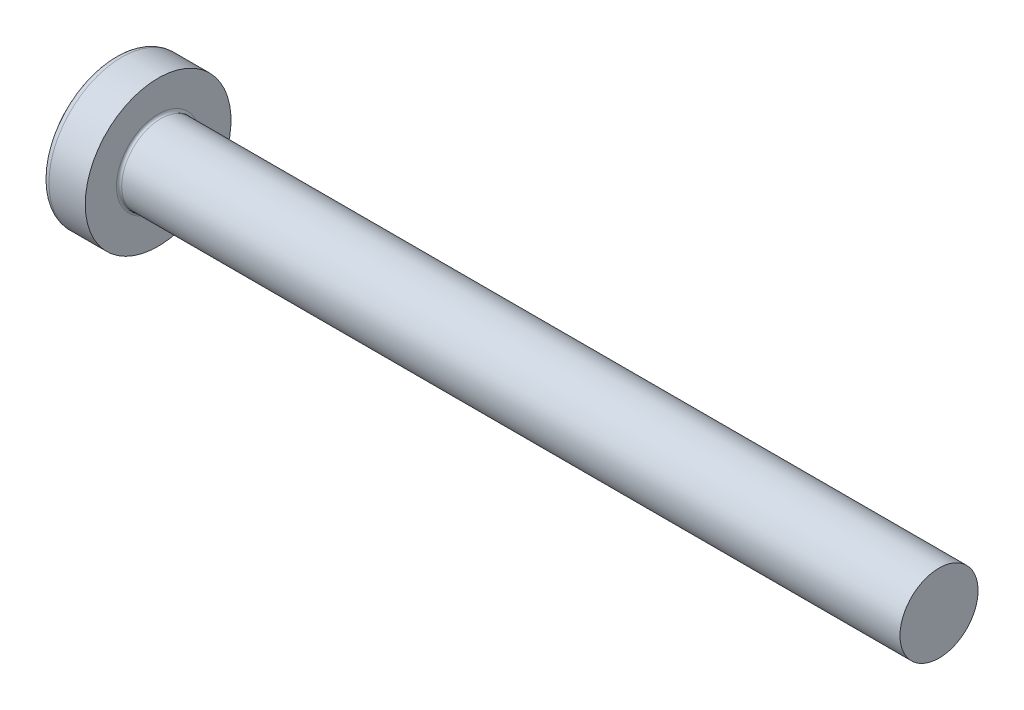
ISO-10303-21;
HEADER;
FILE_DESCRIPTION(('STEP AP214'),'2;1');
FILE_NAME('part.step','',(''),(''),'','','');
FILE_SCHEMA(('AUTOMOTIVE_DESIGN { 1 0 10303 214 1 1 1 1 }'));
ENDSEC;
DATA;
#1=APPLICATION_CONTEXT('core data for automotive mechanical design processes');
#2=APPLICATION_PROTOCOL_DEFINITION('international standard','automotive_design',2000,#1);
#3=PRODUCT_CONTEXT('',#1,'mechanical');
#4=PRODUCT('Part','Part','',(#3));
#5=PRODUCT_RELATED_PRODUCT_CATEGORY('part','',(#4));
#6=PRODUCT_DEFINITION_FORMATION('','',#4);
#7=PRODUCT_DEFINITION_CONTEXT('part definition',#1,'design');
#8=PRODUCT_DEFINITION('design','',#6,#7);
#9=PRODUCT_DEFINITION_SHAPE('','',#8);
#10=(LENGTH_UNIT() NAMED_UNIT(*) SI_UNIT(.MILLI.,.METRE.));
#11=(NAMED_UNIT(*) PLANE_ANGLE_UNIT() SI_UNIT($,.RADIAN.));
#12=(NAMED_UNIT(*) SI_UNIT($,.STERADIAN.) SOLID_ANGLE_UNIT());
#13=UNCERTAINTY_MEASURE_WITH_UNIT(LENGTH_MEASURE(1.E-05),#10,'distance_accuracy_value','');
#14=(GEOMETRIC_REPRESENTATION_CONTEXT(3) GLOBAL_UNCERTAINTY_ASSIGNED_CONTEXT((#13)) GLOBAL_UNIT_ASSIGNED_CONTEXT((#10,
#11,#12)) REPRESENTATION_CONTEXT('',''));
#15=CARTESIAN_POINT('',(0.,0.,0.));
#16=DIRECTION('',(0.,0.,1.));
#17=DIRECTION('',(1.,0.,0.));
#18=AXIS2_PLACEMENT_3D('',#15,#16,#17);
#19=CARTESIAN_POINT('',(5.,0.,0.));
#20=DIRECTION('',(-1.,0.,0.));
#21=DIRECTION('',(0.,1.,0.));
#22=AXIS2_PLACEMENT_3D('',#19,#20,#21);
#23=SPHERICAL_SURFACE('',#22,5.);
#24=CARTESIAN_POINT('',(0.775371598933733,0.,0.));
#25=DIRECTION('',(-1.,0.,0.));
#26=DIRECTION('',(0.,0.,1.));
#27=AXIS2_PLACEMENT_3D('',#24,#25,#26);
#28=CIRCLE('',#27,2.67441860465116);
#29=CARTESIAN_POINT('',(0.775371598933733,0.,2.67441860465116));
#30=VERTEX_POINT('',#29);
#31=EDGE_CURVE('E238',#30,#30,#28,.T.);
#32=ORIENTED_EDGE('',*,*,#31,.T.);
#33=EDGE_LOOP('',(#32));
#34=FACE_BOUND('',#33,.T.);
#35=CARTESIAN_POINT('',(0.0457951200896417,0.,0.));
#36=DIRECTION('',(1.,0.,0.));
#37=DIRECTION('',(0.,0.,-1.));
#38=AXIS2_PLACEMENT_3D('',#35,#36,#37);
#39=CIRCLE('',#38,0.675169614150692);
#40=CARTESIAN_POINT('',(0.0457951200896426,-0.369999999999998,-0.564760133040918));
#41=VERTEX_POINT('',#40);
#42=CARTESIAN_POINT('',(0.0457951200896417,-0.564760133040916,-0.37));
#43=VERTEX_POINT('',#42);
#44=EDGE_CURVE('E374',#41,#43,#39,.F.);
#45=ORIENTED_EDGE('',*,*,#44,.F.);
#46=CARTESIAN_POINT('',(5.,-0.37,0.));
#47=DIRECTION('',(0.,1.,0.));
#48=DIRECTION('',(0.,0.,1.));
#49=AXIS2_PLACEMENT_3D('',#46,#47,#48);
#50=CIRCLE('',#49,4.98629120689917);
#51=CARTESIAN_POINT('',(0.187869731256034,-0.369999999999995,-1.30633161051784));
#52=VERTEX_POINT('',#51);
#53=EDGE_CURVE('E300',#52,#41,#50,.T.);
#54=ORIENTED_EDGE('',*,*,#53,.F.);
#55=CARTESIAN_POINT('',(4.56358245832426,0.,0.875318202045668));
#56=DIRECTION('',(0.446197800778958,0.,-0.89493436774996));
#57=DIRECTION('',(-0.89493436774996,0.,-0.446197800778958));
#58=AXIS2_PLACEMENT_3D('',#55,#56,#57);
#59=CIRCLE('',#58,4.90340267309195);
#60=CARTESIAN_POINT('',(0.187869731256035,0.370000000000005,-1.30633161051784));
#61=VERTEX_POINT('',#60);
#62=EDGE_CURVE('E272',#52,#61,#59,.T.);
#63=ORIENTED_EDGE('',*,*,#62,.T.);
#64=CARTESIAN_POINT('',(5.,0.37,0.));
#65=DIRECTION('',(0.,-1.,0.));
#66=DIRECTION('',(0.,0.,-1.));
#67=AXIS2_PLACEMENT_3D('',#64,#65,#66);
#68=CIRCLE('',#67,4.98629120689917);
#69=CARTESIAN_POINT('',(0.0457951200896421,0.370000000000002,-0.564760133040916));
#70=VERTEX_POINT('',#69);
#71=EDGE_CURVE('E327',#70,#61,#68,.T.);
#72=ORIENTED_EDGE('',*,*,#71,.F.);
#73=CARTESIAN_POINT('',(0.0457951200896417,0.564760133040915,-0.37));
#74=VERTEX_POINT('',#73);
#75=EDGE_CURVE('E393',#74,#70,#39,.F.);
#76=ORIENTED_EDGE('',*,*,#75,.F.);
#77=CARTESIAN_POINT('',(5.,0.,-0.37));
#78=DIRECTION('',(0.,0.,1.));
#79=DIRECTION('',(1.,0.,0.));
#80=AXIS2_PLACEMENT_3D('',#77,#78,#79);
#81=CIRCLE('',#80,4.98629120689917);
#82=CARTESIAN_POINT('',(0.187869731256034,1.30633161051784,-0.37));
#83=VERTEX_POINT('',#82);
#84=EDGE_CURVE('E266',#83,#74,#81,.T.);
#85=ORIENTED_EDGE('',*,*,#84,.F.);
#86=CARTESIAN_POINT('',(4.56358245832426,-0.875318202045668,0.));
#87=DIRECTION('',(0.446197800778958,0.894934367749961,0.));
#88=DIRECTION('',(-0.89493436774996,0.446197800778958,0.));
#89=AXIS2_PLACEMENT_3D('',#86,#87,#88);
#90=CIRCLE('',#89,4.90340267309195);
#91=CARTESIAN_POINT('',(0.187869731256034,1.30633161051784,0.37));
#92=VERTEX_POINT('',#91);
#93=EDGE_CURVE('E269',#83,#92,#90,.T.);
#94=ORIENTED_EDGE('',*,*,#93,.T.);
#95=CARTESIAN_POINT('',(5.,0.,0.37));
#96=DIRECTION('',(0.,0.,-1.));
#97=DIRECTION('',(0.,1.,0.));
#98=AXIS2_PLACEMENT_3D('',#95,#96,#97);
#99=CIRCLE('',#98,4.98629120689917);
#100=CARTESIAN_POINT('',(0.0457951200896417,0.564760133040915,0.37));
#101=VERTEX_POINT('',#100);
#102=EDGE_CURVE('E262',#101,#92,#99,.T.);
#103=ORIENTED_EDGE('',*,*,#102,.F.);
#104=CARTESIAN_POINT('',(0.0457951200896425,0.369999999999998,0.564760133040918));
#105=VERTEX_POINT('',#104);
#106=EDGE_CURVE('E392',#105,#101,#39,.F.);
#107=ORIENTED_EDGE('',*,*,#106,.F.);
#108=CARTESIAN_POINT('',(0.187869731256034,0.369999999999995,1.30633161051784));
#109=VERTEX_POINT('',#108);
#110=EDGE_CURVE('E282',#109,#105,#68,.T.);
#111=ORIENTED_EDGE('',*,*,#110,.F.);
#112=CARTESIAN_POINT('',(4.56358245832426,0.,-0.875318202045668));
#113=DIRECTION('',(0.446197800778958,0.,0.894934367749961));
#114=DIRECTION('',(0.89493436774996,0.,-0.446197800778958));
#115=AXIS2_PLACEMENT_3D('',#112,#113,#114);
#116=CIRCLE('',#115,4.90340267309195);
#117=CARTESIAN_POINT('',(0.187869731256034,-0.370000000000005,1.30633161051784));
#118=VERTEX_POINT('',#117);
#119=EDGE_CURVE('E49',#109,#118,#116,.T.);
#120=ORIENTED_EDGE('',*,*,#119,.T.);
#121=CARTESIAN_POINT('',(0.0457951200896421,-0.370000000000002,0.564760133040916));
#122=VERTEX_POINT('',#121);
#123=EDGE_CURVE('E279',#122,#118,#50,.T.);
#124=ORIENTED_EDGE('',*,*,#123,.F.);
#125=CARTESIAN_POINT('',(0.0457951200896417,-0.564760133040916,0.37));
#126=VERTEX_POINT('',#125);
#127=EDGE_CURVE('E428',#126,#122,#39,.F.);
#128=ORIENTED_EDGE('',*,*,#127,.F.);
#129=CARTESIAN_POINT('',(0.187869731256033,-1.30633161051784,0.37));
#130=VERTEX_POINT('',#129);
#131=EDGE_CURVE('E263',#130,#126,#99,.T.);
#132=ORIENTED_EDGE('',*,*,#131,.F.);
#133=CARTESIAN_POINT('',(4.56358245832426,0.875318202045668,0.));
#134=DIRECTION('',(0.446197800778958,-0.89493436774996,0.));
#135=DIRECTION('',(0.89493436774996,0.446197800778958,0.));
#136=AXIS2_PLACEMENT_3D('',#133,#134,#135);
#137=CIRCLE('',#136,4.90340267309195);
#138=CARTESIAN_POINT('',(0.187869731256033,-1.30633161051784,-0.37));
#139=VERTEX_POINT('',#138);
#140=EDGE_CURVE('E259',#130,#139,#137,.T.);
#141=ORIENTED_EDGE('',*,*,#140,.T.);
#142=EDGE_CURVE('E64',#43,#139,#81,.T.);
#143=ORIENTED_EDGE('',*,*,#142,.F.);
#144=EDGE_LOOP('',(#45,#54,#63,#72,#76,#85,#94,#103,#107,#111,#120,#124,#128,#132,#141,#143));
#145=FACE_BOUND('',#144,.T.);
#146=ADVANCED_FACE('F36',(#34,#145),#23,.T.);
#147=CARTESIAN_POINT('',(1.75,0.527482216012805,-0.37));
#148=DIRECTION('',(0.,0.,1.));
#149=DIRECTION('',(1.,0.,0.));
#150=AXIS2_PLACEMENT_3D('',#147,#148,#149);
#151=PLANE('',#150);
#152=ORIENTED_EDGE('',*,*,#84,.T.);
#153=CARTESIAN_POINT('',(-0.987293237069635,0.649401255968442,-0.37));
#154=CARTESIAN_POINT('',(-0.781914975331301,0.632865887004023,-0.37));
#155=CARTESIAN_POINT('',(-0.576547882405888,0.616188977636102,-0.37));
#156=CARTESIAN_POINT('',(-0.16584159923544,0.582441031964983,-0.37));
#157=CARTESIAN_POINT('',(0.0394975903016338,0.5653699870555,-0.37));
#158=CARTESIAN_POINT('',(0.450133475420601,0.530723441326706,-0.37));
#159=CARTESIAN_POINT('',(0.655430171012341,0.513147940624409,-0.37));
#160=CARTESIAN_POINT('',(1.06596140178858,0.477314957984981,-0.37));
#161=CARTESIAN_POINT('',(1.27119593782008,0.459057485804908,-0.37));
#162=CARTESIAN_POINT('',(1.61065292367297,0.428051938687225,-0.37));
#163=CARTESIAN_POINT('',(1.74490059997313,0.415580824989367,-0.37));
#164=CARTESIAN_POINT('',(2.01334321764434,0.390092023403371,-0.37));
#165=CARTESIAN_POINT('',(2.14753815936247,0.377074339175718,-0.37));
#166=CARTESIAN_POINT('',(2.41586354153627,0.350315629451146,-0.37));
#167=CARTESIAN_POINT('',(2.54999397846979,0.336574568175918,-0.37));
#168=CARTESIAN_POINT('',(2.8181417329714,0.308004077740054,-0.37));
#169=CARTESIAN_POINT('',(2.95215904766802,0.29317462174519,-0.37));
#170=CARTESIAN_POINT('',(3.08609550685347,0.277618485069873,-0.37));
#171=B_SPLINE_CURVE_WITH_KNOTS('',3,(#153,#154,#155,#156,#157,#158,#159,#160,#161,#162,#163,
#164,#165,#166,#167,#168,#169,#170),.UNSPECIFIED.,.F.,.F.,(4,2,2,2,2,2,2,2,4),(0.,
0.61812879398981,1.23627109813549,1.85441325889711,2.47254657920086,2.87702276221884,
3.28149623681436,3.68598973554218,4.09049321035586),.UNSPECIFIED.);
#172=CARTESIAN_POINT('',(1.75,0.415013252800437,-0.370000000000001));
#173=VERTEX_POINT('',#172);
#174=EDGE_CURVE('E414',#74,#173,#171,.T.);
#175=ORIENTED_EDGE('',*,*,#174,.T.);
#176=DIRECTION('',(0.,1.,0.));
#177=VECTOR('',#176,1.);
#178=CARTESIAN_POINT('',(1.75,-0.527482216012805,-0.37));
#179=LINE('',#178,#177);
#180=CARTESIAN_POINT('',(1.75,0.527482216012805,-0.37));
#181=VERTEX_POINT('',#180);
#182=EDGE_CURVE('E356',#173,#181,#179,.T.);
#183=ORIENTED_EDGE('',*,*,#182,.T.);
#184=DIRECTION('',(0.89493436774996,-0.446197800778958,0.));
#185=VECTOR('',#184,1.);
#186=CARTESIAN_POINT('',(0.,1.4,-0.37));
#187=LINE('',#186,#185);
#188=EDGE_CURVE('E239',#83,#181,#187,.T.);
#189=ORIENTED_EDGE('',*,*,#188,.F.);
#190=EDGE_LOOP('',(#152,#175,#183,#189));
#191=FACE_BOUND('',#190,.T.);
#192=ADVANCED_FACE('F194',(#191),#151,.T.);
#193=CARTESIAN_POINT('',(1.75,-0.527482216012805,-0.37));
#194=VERTEX_POINT('',#193);
#195=CARTESIAN_POINT('',(1.75,-0.415013252800437,-0.370000000000001));
#196=VERTEX_POINT('',#195);
#197=EDGE_CURVE('E247',#194,#196,#179,.T.);
#198=ORIENTED_EDGE('',*,*,#197,.T.);
#199=CARTESIAN_POINT('',(-0.987293237069635,-0.649401255968442,-0.37));
#200=CARTESIAN_POINT('',(-0.781914975331301,-0.632865887004023,-0.37));
#201=CARTESIAN_POINT('',(-0.576547882405888,-0.616188977636102,-0.37));
#202=CARTESIAN_POINT('',(-0.16584159923544,-0.582441031964983,-0.37));
#203=CARTESIAN_POINT('',(0.0394975903016338,-0.5653699870555,-0.37));
#204=CARTESIAN_POINT('',(0.450133475420601,-0.530723441326706,-0.37));
#205=CARTESIAN_POINT('',(0.655430171012341,-0.513147940624409,-0.37));
#206=CARTESIAN_POINT('',(1.06596140178858,-0.477314957984981,-0.37));
#207=CARTESIAN_POINT('',(1.27119593782008,-0.459057485804908,-0.37));
#208=CARTESIAN_POINT('',(1.61065292367297,-0.428051938687225,-0.37));
#209=CARTESIAN_POINT('',(1.74490059997313,-0.415580824989367,-0.37));
#210=CARTESIAN_POINT('',(2.01334321764434,-0.390092023403371,-0.37));
#211=CARTESIAN_POINT('',(2.14753815936247,-0.377074339175718,-0.37));
#212=CARTESIAN_POINT('',(2.41586354153627,-0.350315629451146,-0.37));
#213=CARTESIAN_POINT('',(2.54999397846979,-0.336574568175918,-0.37));
#214=CARTESIAN_POINT('',(2.8181417329714,-0.308004077740054,-0.37));
#215=CARTESIAN_POINT('',(2.95215904766802,-0.29317462174519,-0.37));
#216=CARTESIAN_POINT('',(3.08609550685347,-0.277618485069873,-0.37));
#217=B_SPLINE_CURVE_WITH_KNOTS('',3,(#199,#200,#201,#202,#203,#204,#205,#206,#207,#208,#209,
#210,#211,#212,#213,#214,#215,#216),.UNSPECIFIED.,.F.,.F.,(4,2,2,2,2,2,2,2,4),(0.,
0.61812879398981,1.23627109813549,1.85441325889711,2.47254657920086,2.87702276221884,
3.28149623681436,3.68598973554217,4.09049321035586),.UNSPECIFIED.);
#218=EDGE_CURVE('E391',#196,#43,#217,.F.);
#219=ORIENTED_EDGE('',*,*,#218,.T.);
#220=ORIENTED_EDGE('',*,*,#142,.T.);
#221=DIRECTION('',(0.89493436774996,0.446197800778958,0.));
#222=VECTOR('',#221,1.);
#223=CARTESIAN_POINT('',(0.,-1.4,-0.37));
#224=LINE('',#223,#222);
#225=EDGE_CURVE('E330',#139,#194,#224,.T.);
#226=ORIENTED_EDGE('',*,*,#225,.T.);
#227=EDGE_LOOP('',(#198,#219,#220,#226));
#228=FACE_BOUND('',#227,.T.);
#229=ADVANCED_FACE('F200',(#228),#151,.T.);
#230=CARTESIAN_POINT('',(1.75,-0.527482216012805,0.37));
#231=DIRECTION('',(0.,0.,-1.));
#232=DIRECTION('',(0.,1.,0.));
#233=AXIS2_PLACEMENT_3D('',#230,#231,#232);
#234=PLANE('',#233);
#235=DIRECTION('',(0.,-1.,0.));
#236=VECTOR('',#235,1.);
#237=CARTESIAN_POINT('',(1.75,0.527482216012805,0.37));
#238=LINE('',#237,#236);
#239=CARTESIAN_POINT('',(1.75,0.527482216012805,0.37));
#240=VERTEX_POINT('',#239);
#241=CARTESIAN_POINT('',(1.75,0.415013252800437,0.370000000000001));
#242=VERTEX_POINT('',#241);
#243=EDGE_CURVE('E339',#240,#242,#238,.T.);
#244=ORIENTED_EDGE('',*,*,#243,.T.);
#245=CARTESIAN_POINT('',(-0.987293237053716,0.649401255967161,0.37));
#246=CARTESIAN_POINT('',(-0.781914975317084,0.632865887002871,0.37));
#247=CARTESIAN_POINT('',(-0.576547882393372,0.616188977635081,0.37));
#248=CARTESIAN_POINT('',(-0.165841599226327,0.582441031964227,0.37));
#249=CARTESIAN_POINT('',(0.0394975903090453,0.56536998705488,0.37));
#250=CARTESIAN_POINT('',(0.450133475422572,0.530723441326535,0.37));
#251=CARTESIAN_POINT('',(0.655430171010574,0.513147940624557,0.37));
#252=CARTESIAN_POINT('',(1.06596140177934,0.477314957985794,0.37));
#253=CARTESIAN_POINT('',(1.2711959378071,0.459057485806066,0.37));
#254=CARTESIAN_POINT('',(1.61065292365626,0.428051938688768,0.37));
#255=CARTESIAN_POINT('',(1.74490059995643,0.415580824990931,0.37));
#256=CARTESIAN_POINT('',(2.01334321762763,0.390092023404979,0.37));
#257=CARTESIAN_POINT('',(2.14753815934577,0.377074339177353,0.37));
#258=CARTESIAN_POINT('',(2.41586354151957,0.350315629452842,0.37));
#259=CARTESIAN_POINT('',(2.5499939784531,0.33657456817765,0.37));
#260=CARTESIAN_POINT('',(2.81814173295471,0.308004077741875,0.37));
#261=CARTESIAN_POINT('',(2.95215904765134,0.293174621747065,0.37));
#262=CARTESIAN_POINT('',(3.0860955068368,0.277618485071816,0.37));
#263=B_SPLINE_CURVE_WITH_KNOTS('',3,(#245,#246,#247,#248,#249,#250,#251,#252,#253,#254,#255,
#256,#257,#258,#259,#260,#261,#262),.UNSPECIFIED.,.F.,.F.,(4,2,2,2,2,2,2,2,4),(0.,
0.618128793984691,1.23627109812525,1.85441325887562,2.4725465791681,2.87702276218609,
3.28149623678161,3.68598973550942,4.09049321032311),.UNSPECIFIED.);
#264=EDGE_CURVE('E666',#242,#101,#263,.F.);
#265=ORIENTED_EDGE('',*,*,#264,.T.);
#266=ORIENTED_EDGE('',*,*,#102,.T.);
#267=DIRECTION('',(0.89493436774996,-0.446197800778958,0.));
#268=VECTOR('',#267,1.);
#269=CARTESIAN_POINT('',(0.,1.4,0.37));
#270=LINE('',#269,#268);
#271=EDGE_CURVE('E244',#92,#240,#270,.T.);
#272=ORIENTED_EDGE('',*,*,#271,.T.);
#273=EDGE_LOOP('',(#244,#265,#266,#272));
#274=FACE_BOUND('',#273,.T.);
#275=ADVANCED_FACE('F410',(#274),#234,.T.);
#276=ORIENTED_EDGE('',*,*,#131,.T.);
#277=CARTESIAN_POINT('',(-0.987293237069635,-0.649401255968442,0.37));
#278=CARTESIAN_POINT('',(-0.781914975331301,-0.632865887004023,0.37));
#279=CARTESIAN_POINT('',(-0.576547882405888,-0.616188977636102,0.37));
#280=CARTESIAN_POINT('',(-0.16584159923544,-0.582441031964983,0.37));
#281=CARTESIAN_POINT('',(0.0394975903016338,-0.5653699870555,0.37));
#282=CARTESIAN_POINT('',(0.450133475420601,-0.530723441326706,0.37));
#283=CARTESIAN_POINT('',(0.655430171012341,-0.513147940624409,0.37));
#284=CARTESIAN_POINT('',(1.06596140178858,-0.477314957984981,0.37));
#285=CARTESIAN_POINT('',(1.27119593782008,-0.459057485804908,0.37));
#286=CARTESIAN_POINT('',(1.61065292367297,-0.428051938687225,0.37));
#287=CARTESIAN_POINT('',(1.74490059997313,-0.415580824989368,0.37));
#288=CARTESIAN_POINT('',(2.01334321764434,-0.390092023403371,0.37));
#289=CARTESIAN_POINT('',(2.14753815936247,-0.377074339175718,0.37));
#290=CARTESIAN_POINT('',(2.41586354153627,-0.350315629451146,0.37));
#291=CARTESIAN_POINT('',(2.54999397846979,-0.336574568175918,0.37));
#292=CARTESIAN_POINT('',(2.8181417329714,-0.308004077740054,0.37));
#293=CARTESIAN_POINT('',(2.95215904766802,-0.29317462174519,0.37));
#294=CARTESIAN_POINT('',(3.08609550685347,-0.277618485069873,0.37));
#295=B_SPLINE_CURVE_WITH_KNOTS('',3,(#277,#278,#279,#280,#281,#282,#283,#284,#285,#286,#287,
#288,#289,#290,#291,#292,#293,#294),.UNSPECIFIED.,.F.,.F.,(4,2,2,2,2,2,2,2,4),(0.,
0.61812879398981,1.23627109813549,1.85441325889711,2.47254657920086,2.87702276221884,
3.28149623681437,3.68598973554218,4.09049321035586),.UNSPECIFIED.);
#296=CARTESIAN_POINT('',(1.75,-0.415013252800437,0.37));
#297=VERTEX_POINT('',#296);
#298=EDGE_CURVE('E429',#126,#297,#295,.T.);
#299=ORIENTED_EDGE('',*,*,#298,.T.);
#300=CARTESIAN_POINT('',(1.75,-0.527482216012806,0.37));
#301=VERTEX_POINT('',#300);
#302=EDGE_CURVE('E341',#297,#301,#238,.T.);
#303=ORIENTED_EDGE('',*,*,#302,.T.);
#304=DIRECTION('',(0.89493436774996,0.446197800778958,0.));
#305=VECTOR('',#304,1.);
#306=CARTESIAN_POINT('',(0.,-1.4,0.37));
#307=LINE('',#306,#305);
#308=EDGE_CURVE('E332',#130,#301,#307,.T.);
#309=ORIENTED_EDGE('',*,*,#308,.F.);
#310=EDGE_LOOP('',(#276,#299,#303,#309));
#311=FACE_BOUND('',#310,.T.);
#312=ADVANCED_FACE('F520',(#311),#234,.T.);
#313=CARTESIAN_POINT('',(1.75,0.527482216012805,0.37));
#314=DIRECTION('',(0.446197800778958,0.894934367749961,0.));
#315=DIRECTION('',(-0.89493436774996,0.446197800778958,0.));
#316=AXIS2_PLACEMENT_3D('',#313,#314,#315);
#317=PLANE('',#316);
#318=CARTESIAN_POINT('',(2.66965234556629,0.0689604865315898,0.));
#319=DIRECTION('',(0.446197800778958,0.894934367749961,0.));
#320=DIRECTION('',(-0.89493436774996,0.446197800778958,0.));
#321=AXIS2_PLACEMENT_3D('',#318,#319,#320);
#322=ELLIPSE('',#321,1.10195891266117,0.486831719863514);
#323=CARTESIAN_POINT('',(1.75,0.527482216012806,0.175779725196677));
#324=VERTEX_POINT('',#323);
#325=CARTESIAN_POINT('',(1.75,0.527482216012806,-0.175779725196677));
#326=VERTEX_POINT('',#325);
#327=EDGE_CURVE('E305',#324,#326,#322,.F.);
#328=ORIENTED_EDGE('',*,*,#327,.F.);
#329=DIRECTION('',(0.,0.,-1.));
#330=VECTOR('',#329,1.);
#331=CARTESIAN_POINT('',(1.75,0.527482216012805,0.37));
#332=LINE('',#331,#330);
#333=EDGE_CURVE('E342',#240,#324,#332,.T.);
#334=ORIENTED_EDGE('',*,*,#333,.F.);
#335=ORIENTED_EDGE('',*,*,#271,.F.);
#336=ORIENTED_EDGE('',*,*,#93,.F.);
#337=ORIENTED_EDGE('',*,*,#188,.T.);
#338=EDGE_CURVE('E344',#326,#181,#332,.T.);
#339=ORIENTED_EDGE('',*,*,#338,.F.);
#340=EDGE_LOOP('',(#328,#334,#335,#336,#337,#339));
#341=FACE_BOUND('',#340,.T.);
#342=ADVANCED_FACE('F408',(#341),#317,.F.);
#343=CARTESIAN_POINT('',(1.75,-0.527482216012805,-0.37));
#344=DIRECTION('',(0.446197800778958,-0.89493436774996,0.));
#345=DIRECTION('',(0.89493436774996,0.446197800778958,0.));
#346=AXIS2_PLACEMENT_3D('',#343,#344,#345);
#347=PLANE('',#346);
#348=CARTESIAN_POINT('',(2.66965234556629,-0.0689604865315901,0.));
#349=DIRECTION('',(0.446197800778958,-0.89493436774996,0.));
#350=DIRECTION('',(-0.89493436774996,-0.446197800778958,0.));
#351=AXIS2_PLACEMENT_3D('',#348,#349,#350);
#352=ELLIPSE('',#351,1.10195891266117,0.486831719863513);
#353=CARTESIAN_POINT('',(1.75,-0.527482216012806,-0.175779725196677));
#354=VERTEX_POINT('',#353);
#355=CARTESIAN_POINT('',(1.75,-0.527482216012806,0.175779725196677));
#356=VERTEX_POINT('',#355);
#357=EDGE_CURVE('E668',#354,#356,#352,.F.);
#358=ORIENTED_EDGE('',*,*,#357,.F.);
#359=DIRECTION('',(0.,0.,1.));
#360=VECTOR('',#359,1.);
#361=CARTESIAN_POINT('',(1.75,-0.527482216012805,-0.37));
#362=LINE('',#361,#360);
#363=EDGE_CURVE('E335',#194,#354,#362,.T.);
#364=ORIENTED_EDGE('',*,*,#363,.F.);
#365=ORIENTED_EDGE('',*,*,#225,.F.);
#366=ORIENTED_EDGE('',*,*,#140,.F.);
#367=ORIENTED_EDGE('',*,*,#308,.T.);
#368=EDGE_CURVE('E338',#356,#301,#362,.T.);
#369=ORIENTED_EDGE('',*,*,#368,.F.);
#370=EDGE_LOOP('',(#358,#364,#365,#366,#367,#369));
#371=FACE_BOUND('',#370,.T.);
#372=ADVANCED_FACE('F507',(#371),#347,.F.);
#373=CARTESIAN_POINT('',(1.75,0.527482216012805,-0.37));
#374=DIRECTION('',(-1.,0.,0.));
#375=DIRECTION('',(0.,0.,1.));
#376=AXIS2_PLACEMENT_3D('',#373,#374,#375);
#377=PLANE('',#376);
#378=DIRECTION('',(0.,1.,0.));
#379=VECTOR('',#378,1.);
#380=CARTESIAN_POINT('',(1.75,-0.370000000000002,0.527482216012804));
#381=LINE('',#380,#379);
#382=CARTESIAN_POINT('',(1.75,-0.370000000000002,0.527482216012804));
#383=VERTEX_POINT('',#382);
#384=CARTESIAN_POINT('',(1.75,-0.175779725196681,0.527482216012805));
#385=VERTEX_POINT('',#384);
#386=EDGE_CURVE('E320',#383,#385,#381,.T.);
#387=ORIENTED_EDGE('',*,*,#386,.T.);
#388=CARTESIAN_POINT('',(1.75,0.,0.));
#389=DIRECTION('',(-1.,0.,0.));
#390=DIRECTION('',(0.,0.,1.));
#391=AXIS2_PLACEMENT_3D('',#388,#389,#390);
#392=CIRCLE('',#391,0.556);
#393=CARTESIAN_POINT('',(1.75,-0.370000000000001,0.415013252800436));
#394=VERTEX_POINT('',#393);
#395=EDGE_CURVE('E694',#394,#385,#392,.T.);
#396=ORIENTED_EDGE('',*,*,#395,.F.);
#397=DIRECTION('',(0.,0.,-1.));
#398=VECTOR('',#397,1.);
#399=CARTESIAN_POINT('',(1.75,-0.370000000000002,0.527482216012804));
#400=LINE('',#399,#398);
#401=EDGE_CURVE('E316',#383,#394,#400,.T.);
#402=ORIENTED_EDGE('',*,*,#401,.F.);
#403=EDGE_LOOP('',(#387,#396,#402));
#404=FACE_BOUND('',#403,.T.);
#405=ADVANCED_FACE('F464',(#404),#377,.T.);
#406=ORIENTED_EDGE('',*,*,#302,.F.);
#407=EDGE_CURVE('E699',#356,#297,#392,.T.);
#408=ORIENTED_EDGE('',*,*,#407,.F.);
#409=ORIENTED_EDGE('',*,*,#368,.T.);
#410=EDGE_LOOP('',(#406,#408,#409));
#411=FACE_BOUND('',#410,.T.);
#412=ADVANCED_FACE('F494',(#411),#377,.T.);
#413=ORIENTED_EDGE('',*,*,#363,.T.);
#414=EDGE_CURVE('E385',#196,#354,#392,.T.);
#415=ORIENTED_EDGE('',*,*,#414,.F.);
#416=ORIENTED_EDGE('',*,*,#197,.F.);
#417=EDGE_LOOP('',(#413,#415,#416));
#418=FACE_BOUND('',#417,.T.);
#419=ADVANCED_FACE('F488',(#418),#377,.T.);
#420=CARTESIAN_POINT('',(1.75,-0.369999999999998,-0.415013252800438));
#421=VERTEX_POINT('',#420);
#422=CARTESIAN_POINT('',(1.75,-0.369999999999998,-0.527482216012807));
#423=VERTEX_POINT('',#422);
#424=EDGE_CURVE('E319',#421,#423,#400,.T.);
#425=ORIENTED_EDGE('',*,*,#424,.F.);
#426=CARTESIAN_POINT('',(1.75,-0.175779725196677,-0.527482216012806));
#427=VERTEX_POINT('',#426);
#428=EDGE_CURVE('E56',#427,#421,#392,.T.);
#429=ORIENTED_EDGE('',*,*,#428,.F.);
#430=DIRECTION('',(0.,-1.,0.));
#431=VECTOR('',#430,1.);
#432=CARTESIAN_POINT('',(1.75,0.370000000000002,-0.527482216012804));
#433=LINE('',#432,#431);
#434=EDGE_CURVE('E315',#427,#423,#433,.T.);
#435=ORIENTED_EDGE('',*,*,#434,.T.);
#436=EDGE_LOOP('',(#425,#429,#435));
#437=FACE_BOUND('',#436,.T.);
#438=ADVANCED_FACE('F380',(#437),#377,.T.);
#439=CARTESIAN_POINT('',(1.75,0.370000000000002,-0.527482216012804));
#440=VERTEX_POINT('',#439);
#441=CARTESIAN_POINT('',(1.75,0.175779725196681,-0.527482216012805));
#442=VERTEX_POINT('',#441);
#443=EDGE_CURVE('E312',#440,#442,#433,.T.);
#444=ORIENTED_EDGE('',*,*,#443,.T.);
#445=CARTESIAN_POINT('',(1.75,0.370000000000001,-0.415013252800436));
#446=VERTEX_POINT('',#445);
#447=EDGE_CURVE('E384',#446,#442,#392,.T.);
#448=ORIENTED_EDGE('',*,*,#447,.F.);
#449=DIRECTION('',(0.,0.,1.));
#450=VECTOR('',#449,1.);
#451=CARTESIAN_POINT('',(1.75,0.370000000000002,-0.527482216012804));
#452=LINE('',#451,#450);
#453=EDGE_CURVE('E324',#440,#446,#452,.T.);
#454=ORIENTED_EDGE('',*,*,#453,.F.);
#455=EDGE_LOOP('',(#444,#448,#454));
#456=FACE_BOUND('',#455,.T.);
#457=ADVANCED_FACE('F476',(#456),#377,.T.);
#458=ORIENTED_EDGE('',*,*,#182,.F.);
#459=EDGE_CURVE('E683',#326,#173,#392,.T.);
#460=ORIENTED_EDGE('',*,*,#459,.F.);
#461=ORIENTED_EDGE('',*,*,#338,.T.);
#462=EDGE_LOOP('',(#458,#460,#461));
#463=FACE_BOUND('',#462,.T.);
#464=ADVANCED_FACE('F470',(#463),#377,.T.);
#465=ORIENTED_EDGE('',*,*,#333,.T.);
#466=EDGE_CURVE('E685',#242,#324,#392,.T.);
#467=ORIENTED_EDGE('',*,*,#466,.F.);
#468=ORIENTED_EDGE('',*,*,#243,.F.);
#469=EDGE_LOOP('',(#465,#467,#468));
#470=FACE_BOUND('',#469,.T.);
#471=ADVANCED_FACE('F462',(#470),#377,.T.);
#472=CARTESIAN_POINT('',(1.75,0.369999999999998,0.415013252800439));
#473=VERTEX_POINT('',#472);
#474=CARTESIAN_POINT('',(1.75,0.369999999999998,0.527482216012807));
#475=VERTEX_POINT('',#474);
#476=EDGE_CURVE('E297',#473,#475,#452,.T.);
#477=ORIENTED_EDGE('',*,*,#476,.F.);
#478=CARTESIAN_POINT('',(1.75,0.175779725196677,0.527482216012806));
#479=VERTEX_POINT('',#478);
#480=EDGE_CURVE('E386',#479,#473,#392,.T.);
#481=ORIENTED_EDGE('',*,*,#480,.F.);
#482=EDGE_CURVE('E323',#479,#475,#381,.T.);
#483=ORIENTED_EDGE('',*,*,#482,.T.);
#484=EDGE_LOOP('',(#477,#481,#483));
#485=FACE_BOUND('',#484,.T.);
#486=ADVANCED_FACE('F456',(#485),#377,.T.);
#487=CARTESIAN_POINT('',(1.75,0.369999999999998,0.527482216012807));
#488=DIRECTION('',(0.,-1.,0.));
#489=DIRECTION('',(1.,0.,0.));
#490=AXIS2_PLACEMENT_3D('',#487,#488,#489);
#491=PLANE('',#490);
#492=ORIENTED_EDGE('',*,*,#110,.T.);
#493=CARTESIAN_POINT('',(-0.987293237053716,0.369999999999998,0.649401255967162));
#494=CARTESIAN_POINT('',(-0.781914975317084,0.369999999999998,0.632865887002872));
#495=CARTESIAN_POINT('',(-0.576547882393372,0.369999999999998,0.616188977635082));
#496=CARTESIAN_POINT('',(-0.165841599226327,0.369999999999998,0.582441031964228));
#497=CARTESIAN_POINT('',(0.0394975903090453,0.369999999999998,0.565369987054881));
#498=CARTESIAN_POINT('',(0.450133475422572,0.369999999999998,0.530723441326536));
#499=CARTESIAN_POINT('',(0.655430171010573,0.369999999999998,0.513147940624558));
#500=CARTESIAN_POINT('',(1.06596140177934,0.369999999999998,0.477314957985795));
#501=CARTESIAN_POINT('',(1.2711959378071,0.369999999999998,0.459057485806067));
#502=CARTESIAN_POINT('',(1.61065292365626,0.369999999999998,0.42805193868877));
#503=CARTESIAN_POINT('',(1.74490059995643,0.369999999999998,0.415580824990932));
#504=CARTESIAN_POINT('',(2.01334321762763,0.369999999999999,0.390092023404981));
#505=CARTESIAN_POINT('',(2.14753815934577,0.369999999999999,0.377074339177355));
#506=CARTESIAN_POINT('',(2.41586354151957,0.369999999999999,0.350315629452844));
#507=CARTESIAN_POINT('',(2.5499939784531,0.369999999999999,0.336574568177652));
#508=CARTESIAN_POINT('',(2.81814173295471,0.369999999999999,0.308004077741877));
#509=CARTESIAN_POINT('',(2.95215904765134,0.369999999999999,0.293174621747066));
#510=CARTESIAN_POINT('',(3.0860955068368,0.369999999999999,0.277618485071817));
#511=B_SPLINE_CURVE_WITH_KNOTS('',3,(#493,#494,#495,#496,#497,#498,#499,#500,#501,#502,#503,
#504,#505,#506,#507,#508,#509,#510),.UNSPECIFIED.,.F.,.F.,(4,2,2,2,2,2,2,2,4),(0.,
0.618128793984691,1.23627109812525,1.85441325887562,2.4725465791681,2.87702276218609,
3.28149623678161,3.68598973550942,4.09049321032311),.UNSPECIFIED.);
#512=EDGE_CURVE('E665',#105,#473,#511,.T.);
#513=ORIENTED_EDGE('',*,*,#512,.T.);
#514=ORIENTED_EDGE('',*,*,#476,.T.);
#515=DIRECTION('',(0.89493436774996,0.,-0.446197800778958));
#516=VECTOR('',#515,1.);
#517=CARTESIAN_POINT('',(0.,0.369999999999995,1.4));
#518=LINE('',#517,#516);
#519=EDGE_CURVE('E290',#109,#475,#518,.T.);
#520=ORIENTED_EDGE('',*,*,#519,.F.);
#521=EDGE_LOOP('',(#492,#513,#514,#520));
#522=FACE_BOUND('',#521,.T.);
#523=ADVANCED_FACE('F294',(#522),#491,.T.);
#524=CARTESIAN_POINT('',(1.75,-0.369999999999998,-0.527482216012807));
#525=DIRECTION('',(0.,1.,0.));
#526=DIRECTION('',(0.,0.,1.));
#527=AXIS2_PLACEMENT_3D('',#524,#525,#526);
#528=PLANE('',#527);
#529=ORIENTED_EDGE('',*,*,#401,.T.);
#530=CARTESIAN_POINT('',(-0.987293237053716,-0.370000000000002,0.64940125596716));
#531=CARTESIAN_POINT('',(-0.781914975317084,-0.370000000000002,0.63286588700287));
#532=CARTESIAN_POINT('',(-0.576547882393372,-0.370000000000002,0.61618897763508));
#533=CARTESIAN_POINT('',(-0.165841599226327,-0.370000000000002,0.582441031964225));
#534=CARTESIAN_POINT('',(0.0394975903090451,-0.370000000000002,0.565369987054878));
#535=CARTESIAN_POINT('',(0.450133475422572,-0.370000000000002,0.530723441326533));
#536=CARTESIAN_POINT('',(0.655430171010573,-0.370000000000002,0.513147940624555));
#537=CARTESIAN_POINT('',(1.06596140177934,-0.370000000000002,0.477314957985793));
#538=CARTESIAN_POINT('',(1.2711959378071,-0.370000000000002,0.459057485806065));
#539=CARTESIAN_POINT('',(1.61065292365626,-0.370000000000001,0.428051938688767));
#540=CARTESIAN_POINT('',(1.74490059995642,-0.370000000000001,0.41558082499093));
#541=CARTESIAN_POINT('',(2.01334321762763,-0.370000000000001,0.390092023404978));
#542=CARTESIAN_POINT('',(2.14753815934577,-0.370000000000001,0.377074339177352));
#543=CARTESIAN_POINT('',(2.41586354151957,-0.370000000000001,0.350315629452841));
#544=CARTESIAN_POINT('',(2.5499939784531,-0.370000000000001,0.336574568177649));
#545=CARTESIAN_POINT('',(2.81814173295471,-0.370000000000001,0.308004077741874));
#546=CARTESIAN_POINT('',(2.95215904765134,-0.370000000000001,0.293174621747063));
#547=CARTESIAN_POINT('',(3.0860955068368,-0.370000000000001,0.277618485071814));
#548=B_SPLINE_CURVE_WITH_KNOTS('',3,(#530,#531,#532,#533,#534,#535,#536,#537,#538,#539,#540,
#541,#542,#543,#544,#545,#546,#547),.UNSPECIFIED.,.F.,.F.,(4,2,2,2,2,2,2,2,4),(0.,
0.618128793984691,1.23627109812525,1.85441325887562,2.4725465791681,2.87702276218609,
3.28149623678161,3.68598973550942,4.09049321032311),.UNSPECIFIED.);
#549=EDGE_CURVE('E422',#394,#122,#548,.F.);
#550=ORIENTED_EDGE('',*,*,#549,.T.);
#551=ORIENTED_EDGE('',*,*,#123,.T.);
#552=DIRECTION('',(0.89493436774996,0.,-0.446197800778958));
#553=VECTOR('',#552,1.);
#554=CARTESIAN_POINT('',(0.,-0.370000000000005,1.4));
#555=LINE('',#554,#553);
#556=EDGE_CURVE('E292',#118,#383,#555,.T.);
#557=ORIENTED_EDGE('',*,*,#556,.T.);
#558=EDGE_LOOP('',(#529,#550,#551,#557));
#559=FACE_BOUND('',#558,.T.);
#560=ADVANCED_FACE('F229',(#559),#528,.T.);
#561=CARTESIAN_POINT('',(1.75,-0.370000000000002,0.527482216012804));
#562=DIRECTION('',(0.446197800778958,0.,0.894934367749961));
#563=DIRECTION('',(-0.89493436774996,0.,0.446197800778958));
#564=AXIS2_PLACEMENT_3D('',#561,#562,#563);
#565=PLANE('',#564);
#566=CARTESIAN_POINT('',(2.66965234556629,0.,0.0689604865315898));
#567=DIRECTION('',(0.446197800778958,0.,0.894934367749961));
#568=DIRECTION('',(-0.89493436774996,0.,0.446197800778958));
#569=AXIS2_PLACEMENT_3D('',#566,#567,#568);
#570=ELLIPSE('',#569,1.10195891266117,0.486831719863514);
#571=EDGE_CURVE('E420',#385,#479,#570,.F.);
#572=ORIENTED_EDGE('',*,*,#571,.F.);
#573=ORIENTED_EDGE('',*,*,#386,.F.);
#574=ORIENTED_EDGE('',*,*,#556,.F.);
#575=ORIENTED_EDGE('',*,*,#119,.F.);
#576=ORIENTED_EDGE('',*,*,#519,.T.);
#577=ORIENTED_EDGE('',*,*,#482,.F.);
#578=EDGE_LOOP('',(#572,#573,#574,#575,#576,#577));
#579=FACE_BOUND('',#578,.T.);
#580=ADVANCED_FACE('F288',(#579),#565,.F.);
#581=CARTESIAN_POINT('',(1.75,0.370000000000002,-0.527482216012804));
#582=DIRECTION('',(0.446197800778958,0.,-0.89493436774996));
#583=DIRECTION('',(0.89493436774996,0.,0.446197800778958));
#584=AXIS2_PLACEMENT_3D('',#581,#582,#583);
#585=PLANE('',#584);
#586=CARTESIAN_POINT('',(2.66965234556629,0.,-0.0689604865315901));
#587=DIRECTION('',(0.446197800778958,0.,-0.89493436774996));
#588=DIRECTION('',(-0.89493436774996,0.,-0.446197800778958));
#589=AXIS2_PLACEMENT_3D('',#586,#587,#588);
#590=ELLIPSE('',#589,1.10195891266117,0.486831719863513);
#591=EDGE_CURVE('E378',#442,#427,#590,.F.);
#592=ORIENTED_EDGE('',*,*,#591,.F.);
#593=ORIENTED_EDGE('',*,*,#443,.F.);
#594=DIRECTION('',(0.89493436774996,0.,0.446197800778958));
#595=VECTOR('',#594,1.);
#596=CARTESIAN_POINT('',(0.,0.370000000000005,-1.4));
#597=LINE('',#596,#595);
#598=EDGE_CURVE('E302',#61,#440,#597,.T.);
#599=ORIENTED_EDGE('',*,*,#598,.F.);
#600=ORIENTED_EDGE('',*,*,#62,.F.);
#601=DIRECTION('',(0.89493436774996,0.,0.446197800778958));
#602=VECTOR('',#601,1.);
#603=CARTESIAN_POINT('',(0.,-0.369999999999995,-1.4));
#604=LINE('',#603,#602);
#605=EDGE_CURVE('E309',#52,#423,#604,.T.);
#606=ORIENTED_EDGE('',*,*,#605,.T.);
#607=ORIENTED_EDGE('',*,*,#434,.F.);
#608=EDGE_LOOP('',(#592,#593,#599,#600,#606,#607));
#609=FACE_BOUND('',#608,.T.);
#610=ADVANCED_FACE('F369',(#609),#585,.F.);
#611=ORIENTED_EDGE('',*,*,#453,.T.);
#612=CARTESIAN_POINT('',(-0.987293237069635,0.370000000000002,-0.649401255968441));
#613=CARTESIAN_POINT('',(-0.781914975331301,0.370000000000002,-0.632865887004022));
#614=CARTESIAN_POINT('',(-0.576547882405888,0.370000000000002,-0.616188977636101));
#615=CARTESIAN_POINT('',(-0.16584159923544,0.370000000000002,-0.582441031964981));
#616=CARTESIAN_POINT('',(0.0394975903016338,0.370000000000002,-0.565369987055499));
#617=CARTESIAN_POINT('',(0.450133475420601,0.370000000000002,-0.530723441326705));
#618=CARTESIAN_POINT('',(0.655430171012341,0.370000000000002,-0.513147940624407));
#619=CARTESIAN_POINT('',(1.06596140178858,0.370000000000002,-0.47731495798498));
#620=CARTESIAN_POINT('',(1.27119593782008,0.370000000000002,-0.459057485804906));
#621=CARTESIAN_POINT('',(1.61065292367297,0.370000000000001,-0.428051938687223));
#622=CARTESIAN_POINT('',(1.74490059997313,0.370000000000001,-0.415580824989366));
#623=CARTESIAN_POINT('',(2.01334321764434,0.370000000000001,-0.390092023403369));
#624=CARTESIAN_POINT('',(2.14753815936247,0.370000000000001,-0.377074339175717));
#625=CARTESIAN_POINT('',(2.41586354153627,0.370000000000001,-0.350315629451145));
#626=CARTESIAN_POINT('',(2.54999397846979,0.370000000000001,-0.336574568175917));
#627=CARTESIAN_POINT('',(2.8181417329714,0.370000000000001,-0.308004077740052));
#628=CARTESIAN_POINT('',(2.95215904766802,0.370000000000001,-0.293174621745188));
#629=CARTESIAN_POINT('',(3.08609550685347,0.370000000000001,-0.277618485069872));
#630=B_SPLINE_CURVE_WITH_KNOTS('',3,(#612,#613,#614,#615,#616,#617,#618,#619,#620,#621,#622,
#623,#624,#625,#626,#627,#628,#629),.UNSPECIFIED.,.F.,.F.,(4,2,2,2,2,2,2,2,4),(0.,
0.61812879398981,1.23627109813549,1.85441325889711,2.47254657920086,2.87702276221884,
3.28149623681436,3.68598973554217,4.09049321035586),.UNSPECIFIED.);
#631=EDGE_CURVE('E365',#446,#70,#630,.F.);
#632=ORIENTED_EDGE('',*,*,#631,.T.);
#633=ORIENTED_EDGE('',*,*,#71,.T.);
#634=ORIENTED_EDGE('',*,*,#598,.T.);
#635=EDGE_LOOP('',(#611,#632,#633,#634));
#636=FACE_BOUND('',#635,.T.);
#637=ADVANCED_FACE('F227',(#636),#491,.T.);
#638=ORIENTED_EDGE('',*,*,#53,.T.);
#639=CARTESIAN_POINT('',(-0.987293237069635,-0.369999999999997,-0.649401255968443));
#640=CARTESIAN_POINT('',(-0.781914975331301,-0.369999999999997,-0.632865887004025));
#641=CARTESIAN_POINT('',(-0.576547882405888,-0.369999999999997,-0.616188977636104));
#642=CARTESIAN_POINT('',(-0.16584159923544,-0.369999999999998,-0.582441031964984));
#643=CARTESIAN_POINT('',(0.0394975903016337,-0.369999999999998,-0.565369987055501));
#644=CARTESIAN_POINT('',(0.450133475420601,-0.369999999999998,-0.530723441326707));
#645=CARTESIAN_POINT('',(0.655430171012341,-0.369999999999998,-0.51314794062441));
#646=CARTESIAN_POINT('',(1.06596140178858,-0.369999999999998,-0.477314957984982));
#647=CARTESIAN_POINT('',(1.27119593782008,-0.369999999999998,-0.459057485804909));
#648=CARTESIAN_POINT('',(1.61065292367297,-0.369999999999998,-0.428051938687226));
#649=CARTESIAN_POINT('',(1.74490059997313,-0.369999999999998,-0.415580824989369));
#650=CARTESIAN_POINT('',(2.01334321764434,-0.369999999999999,-0.390092023403372));
#651=CARTESIAN_POINT('',(2.14753815936247,-0.369999999999999,-0.37707433917572));
#652=CARTESIAN_POINT('',(2.41586354153627,-0.369999999999999,-0.350315629451147));
#653=CARTESIAN_POINT('',(2.54999397846979,-0.369999999999999,-0.336574568175919));
#654=CARTESIAN_POINT('',(2.8181417329714,-0.369999999999999,-0.308004077740055));
#655=CARTESIAN_POINT('',(2.95215904766802,-0.369999999999999,-0.293174621745191));
#656=CARTESIAN_POINT('',(3.08609550685347,-0.369999999999999,-0.277618485069875));
#657=B_SPLINE_CURVE_WITH_KNOTS('',3,(#639,#640,#641,#642,#643,#644,#645,#646,#647,#648,#649,
#650,#651,#652,#653,#654,#655,#656),.UNSPECIFIED.,.F.,.F.,(4,2,2,2,2,2,2,2,4),(0.,
0.61812879398981,1.23627109813549,1.85441325889711,2.47254657920086,2.87702276221884,
3.28149623681436,3.68598973554218,4.09049321035586),.UNSPECIFIED.);
#658=EDGE_CURVE('E11',#41,#421,#657,.T.);
#659=ORIENTED_EDGE('',*,*,#658,.T.);
#660=ORIENTED_EDGE('',*,*,#424,.T.);
#661=ORIENTED_EDGE('',*,*,#605,.F.);
#662=EDGE_LOOP('',(#638,#659,#660,#661));
#663=FACE_BOUND('',#662,.T.);
#664=ADVANCED_FACE('F222',(#663),#528,.T.);
#665=CARTESIAN_POINT('',(-25.4,0.,0.));
#666=DIRECTION('',(-1.,0.,0.));
#667=DIRECTION('',(0.,0.,1.));
#668=AXIS2_PLACEMENT_3D('',#665,#666,#667);
#669=CYLINDRICAL_SURFACE('',#668,1.5);
#670=CARTESIAN_POINT('',(2.5,0.,0.));
#671=DIRECTION('',(-1.,0.,0.));
#672=DIRECTION('',(0.,0.,1.));
#673=AXIS2_PLACEMENT_3D('',#670,#671,#672);
#674=CIRCLE('',#673,1.5);
#675=CARTESIAN_POINT('',(2.5,0.,1.5));
#676=VERTEX_POINT('',#675);
#677=EDGE_CURVE('E233',#676,#676,#674,.F.);
#678=ORIENTED_EDGE('',*,*,#677,.T.);
#679=EDGE_LOOP('',(#678));
#680=FACE_BOUND('',#679,.T.);
#681=CARTESIAN_POINT('',(32.4,0.,0.));
#682=DIRECTION('',(-1.,0.,0.));
#683=DIRECTION('',(0.,0.,1.));
#684=AXIS2_PLACEMENT_3D('',#681,#682,#683);
#685=CIRCLE('',#684,1.5);
#686=CARTESIAN_POINT('',(32.4,0.,1.5));
#687=VERTEX_POINT('',#686);
#688=EDGE_CURVE('E236',#687,#687,#685,.T.);
#689=ORIENTED_EDGE('',*,*,#688,.T.);
#690=EDGE_LOOP('',(#689));
#691=FACE_BOUND('',#690,.T.);
#692=ADVANCED_FACE('F219',(#680,#691),#669,.T.);
#693=CARTESIAN_POINT('',(2.4,1.5,0.));
#694=DIRECTION('',(-1.,0.,0.));
#695=DIRECTION('',(0.,0.,1.));
#696=AXIS2_PLACEMENT_3D('',#693,#694,#695);
#697=PLANE('',#696);
#698=CARTESIAN_POINT('',(2.4,0.,0.));
#699=DIRECTION('',(-1.,0.,0.));
#700=DIRECTION('',(0.,0.,1.));
#701=AXIS2_PLACEMENT_3D('',#698,#699,#700);
#702=CIRCLE('',#701,1.6);
#703=CARTESIAN_POINT('',(2.4,0.,1.6));
#704=VERTEX_POINT('',#703);
#705=EDGE_CURVE('E255',#704,#704,#702,.T.);
#706=ORIENTED_EDGE('',*,*,#705,.T.);
#707=EDGE_LOOP('',(#706));
#708=FACE_BOUND('',#707,.T.);
#709=CARTESIAN_POINT('',(2.4,0.,0.));
#710=DIRECTION('',(-1.,0.,0.));
#711=DIRECTION('',(0.,0.,1.));
#712=AXIS2_PLACEMENT_3D('',#709,#710,#711);
#713=CIRCLE('',#712,2.8);
#714=CARTESIAN_POINT('',(2.4,0.,2.8));
#715=VERTEX_POINT('',#714);
#716=EDGE_CURVE('E252',#715,#715,#713,.T.);
#717=ORIENTED_EDGE('',*,*,#716,.F.);
#718=EDGE_LOOP('',(#717));
#719=FACE_BOUND('',#718,.T.);
#720=ADVANCED_FACE('F216',(#708,#719),#697,.F.);
#721=CARTESIAN_POINT('',(-25.4,0.,0.));
#722=DIRECTION('',(-1.,0.,0.));
#723=DIRECTION('',(0.,0.,1.));
#724=AXIS2_PLACEMENT_3D('',#721,#722,#723);
#725=CYLINDRICAL_SURFACE('',#724,2.8);
#726=ORIENTED_EDGE('',*,*,#716,.T.);
#727=EDGE_LOOP('',(#726));
#728=FACE_BOUND('',#727,.T.);
#729=CARTESIAN_POINT('',(1.00350153259131,0.,0.));
#730=DIRECTION('',(-1.,0.,0.));
#731=DIRECTION('',(0.,0.,1.));
#732=AXIS2_PLACEMENT_3D('',#729,#730,#731);
#733=CIRCLE('',#732,2.8);
#734=CARTESIAN_POINT('',(1.00350153259131,0.,2.8));
#735=VERTEX_POINT('',#734);
#736=EDGE_CURVE('E241',#735,#735,#733,.T.);
#737=ORIENTED_EDGE('',*,*,#736,.F.);
#738=EDGE_LOOP('',(#737));
#739=FACE_BOUND('',#738,.T.);
#740=ADVANCED_FACE('F212',(#728,#739),#725,.T.);
#741=CARTESIAN_POINT('',(1.00350153259131,0.,0.));
#742=DIRECTION('',(-1.,0.,0.));
#743=DIRECTION('',(0.,0.,1.));
#744=AXIS2_PLACEMENT_3D('',#741,#742,#743);
#745=TOROIDAL_SURFACE('',#744,2.53,0.27);
#746=ORIENTED_EDGE('',*,*,#736,.T.);
#747=EDGE_LOOP('',(#746));
#748=FACE_BOUND('',#747,.T.);
#749=ORIENTED_EDGE('',*,*,#31,.F.);
#750=EDGE_LOOP('',(#749));
#751=FACE_BOUND('',#750,.T.);
#752=ADVANCED_FACE('F209',(#748,#751),#745,.T.);
#753=CARTESIAN_POINT('',(32.4,1.5,0.));
#754=DIRECTION('',(1.,0.,0.));
#755=DIRECTION('',(0.,0.,-1.));
#756=AXIS2_PLACEMENT_3D('',#753,#754,#755);
#757=PLANE('',#756);
#758=ORIENTED_EDGE('',*,*,#688,.F.);
#759=EDGE_LOOP('',(#758));
#760=FACE_BOUND('',#759,.T.);
#761=ADVANCED_FACE('F207',(#760),#757,.T.);
#762=CARTESIAN_POINT('',(2.5,0.,0.));
#763=DIRECTION('',(-1.,0.,0.));
#764=DIRECTION('',(0.,0.,1.));
#765=AXIS2_PLACEMENT_3D('',#762,#763,#764);
#766=TOROIDAL_SURFACE('',#765,1.6,0.1);
#767=ORIENTED_EDGE('',*,*,#677,.F.);
#768=EDGE_LOOP('',(#767));
#769=FACE_BOUND('',#768,.T.);
#770=ORIENTED_EDGE('',*,*,#705,.F.);
#771=EDGE_LOOP('',(#770));
#772=FACE_BOUND('',#771,.T.);
#773=ADVANCED_FACE('F38',(#769,#772),#766,.F.);
#774=CARTESIAN_POINT('',(1.75,0.,0.));
#775=DIRECTION('',(-1.,0.,0.));
#776=DIRECTION('',(0.,0.,1.));
#777=AXIS2_PLACEMENT_3D('',#774,#775,#776);
#778=CONICAL_SURFACE('',#777,0.556,0.0698131700797659);
#779=ORIENTED_EDGE('',*,*,#327,.T.);
#780=EDGE_CURVE('E680',#324,#326,#392,.T.);
#781=ORIENTED_EDGE('',*,*,#780,.F.);
#782=EDGE_LOOP('',(#779,#781));
#783=FACE_BOUND('',#782,.T.);
#784=ADVANCED_FACE('F191',(#783),#778,.F.);
#785=ORIENTED_EDGE('',*,*,#357,.T.);
#786=EDGE_CURVE('E700',#354,#356,#392,.T.);
#787=ORIENTED_EDGE('',*,*,#786,.F.);
#788=EDGE_LOOP('',(#785,#787));
#789=FACE_BOUND('',#788,.T.);
#790=ADVANCED_FACE('F595',(#789),#778,.F.);
#791=EDGE_CURVE('E388',#473,#242,#392,.T.);
#792=ORIENTED_EDGE('',*,*,#791,.F.);
#793=ORIENTED_EDGE('',*,*,#512,.F.);
#794=ORIENTED_EDGE('',*,*,#106,.T.);
#795=ORIENTED_EDGE('',*,*,#264,.F.);
#796=EDGE_LOOP('',(#792,#793,#794,#795));
#797=FACE_BOUND('',#796,.T.);
#798=ADVANCED_FACE('F602',(#797),#778,.F.);
#799=ORIENTED_EDGE('',*,*,#571,.T.);
#800=EDGE_CURVE('E389',#385,#479,#392,.T.);
#801=ORIENTED_EDGE('',*,*,#800,.F.);
#802=EDGE_LOOP('',(#799,#801));
#803=FACE_BOUND('',#802,.T.);
#804=ADVANCED_FACE('F609',(#803),#778,.F.);
#805=ORIENTED_EDGE('',*,*,#591,.T.);
#806=EDGE_CURVE('E381',#442,#427,#392,.T.);
#807=ORIENTED_EDGE('',*,*,#806,.F.);
#808=EDGE_LOOP('',(#805,#807));
#809=FACE_BOUND('',#808,.T.);
#810=ADVANCED_FACE('F616',(#809),#778,.F.);
#811=ORIENTED_EDGE('',*,*,#127,.T.);
#812=ORIENTED_EDGE('',*,*,#549,.F.);
#813=EDGE_CURVE('E696',#297,#394,#392,.T.);
#814=ORIENTED_EDGE('',*,*,#813,.F.);
#815=ORIENTED_EDGE('',*,*,#298,.F.);
#816=EDGE_LOOP('',(#811,#812,#814,#815));
#817=FACE_BOUND('',#816,.T.);
#818=ADVANCED_FACE('F623',(#817),#778,.F.);
#819=ORIENTED_EDGE('',*,*,#75,.T.);
#820=ORIENTED_EDGE('',*,*,#631,.F.);
#821=EDGE_CURVE('E686',#173,#446,#392,.T.);
#822=ORIENTED_EDGE('',*,*,#821,.F.);
#823=ORIENTED_EDGE('',*,*,#174,.F.);
#824=EDGE_LOOP('',(#819,#820,#822,#823));
#825=FACE_BOUND('',#824,.T.);
#826=ADVANCED_FACE('F189',(#825),#778,.F.);
#827=EDGE_CURVE('E382',#421,#196,#392,.T.);
#828=ORIENTED_EDGE('',*,*,#827,.F.);
#829=ORIENTED_EDGE('',*,*,#658,.F.);
#830=ORIENTED_EDGE('',*,*,#44,.T.);
#831=ORIENTED_EDGE('',*,*,#218,.F.);
#832=EDGE_LOOP('',(#828,#829,#830,#831));
#833=FACE_BOUND('',#832,.T.);
#834=ADVANCED_FACE('F184',(#833),#778,.F.);
#835=CARTESIAN_POINT('',(1.93065535110549,0.,0.));
#836=DIRECTION('',(-1.,0.,0.));
#837=DIRECTION('',(0.,0.,1.));
#838=AXIS2_PLACEMENT_3D('',#835,#836,#837);
#839=CONICAL_SURFACE('',#838,0.,1.25663706143592);
#840=ORIENTED_EDGE('',*,*,#480,.T.);
#841=ORIENTED_EDGE('',*,*,#791,.T.);
#842=ORIENTED_EDGE('',*,*,#466,.T.);
#843=ORIENTED_EDGE('',*,*,#780,.T.);
#844=ORIENTED_EDGE('',*,*,#459,.T.);
#845=ORIENTED_EDGE('',*,*,#821,.T.);
#846=ORIENTED_EDGE('',*,*,#447,.T.);
#847=ORIENTED_EDGE('',*,*,#806,.T.);
#848=ORIENTED_EDGE('',*,*,#428,.T.);
#849=ORIENTED_EDGE('',*,*,#827,.T.);
#850=ORIENTED_EDGE('',*,*,#414,.T.);
#851=ORIENTED_EDGE('',*,*,#786,.T.);
#852=ORIENTED_EDGE('',*,*,#407,.T.);
#853=ORIENTED_EDGE('',*,*,#813,.T.);
#854=ORIENTED_EDGE('',*,*,#395,.T.);
#855=ORIENTED_EDGE('',*,*,#800,.T.);
#856=EDGE_LOOP('',(#840,#841,#842,#843,#844,#845,#846,#847,#848,#849,#850,#851,#852,#853,#854,#855));
#857=FACE_BOUND('',#856,.T.);
#858=CARTESIAN_POINT('',(1.93065535110549,0.,0.));
#859=VERTEX_POINT('',#858);
#860=VERTEX_LOOP('',#859);
#861=FACE_BOUND('',#860,.T.);
#862=ADVANCED_FACE('F182',(#857,#861),#839,.F.);
#863=CLOSED_SHELL('',(#146,#192,#229,#275,#312,#342,#372,#405,#412,#419,#438,#457,#464,#471,
#486,#523,#560,#580,#610,#637,#664,#692,#720,#740,#752,#761,#773,#784,#790,#798,#804,#810,#818,
#826,#834,#862));
#864=MANIFOLD_SOLID_BREP('B2',#863);
#865=ADVANCED_BREP_SHAPE_REPRESENTATION('',(#18,#864),#14);
#866=SHAPE_DEFINITION_REPRESENTATION(#9,#865);
ENDSEC;
END-ISO-10303-21;
